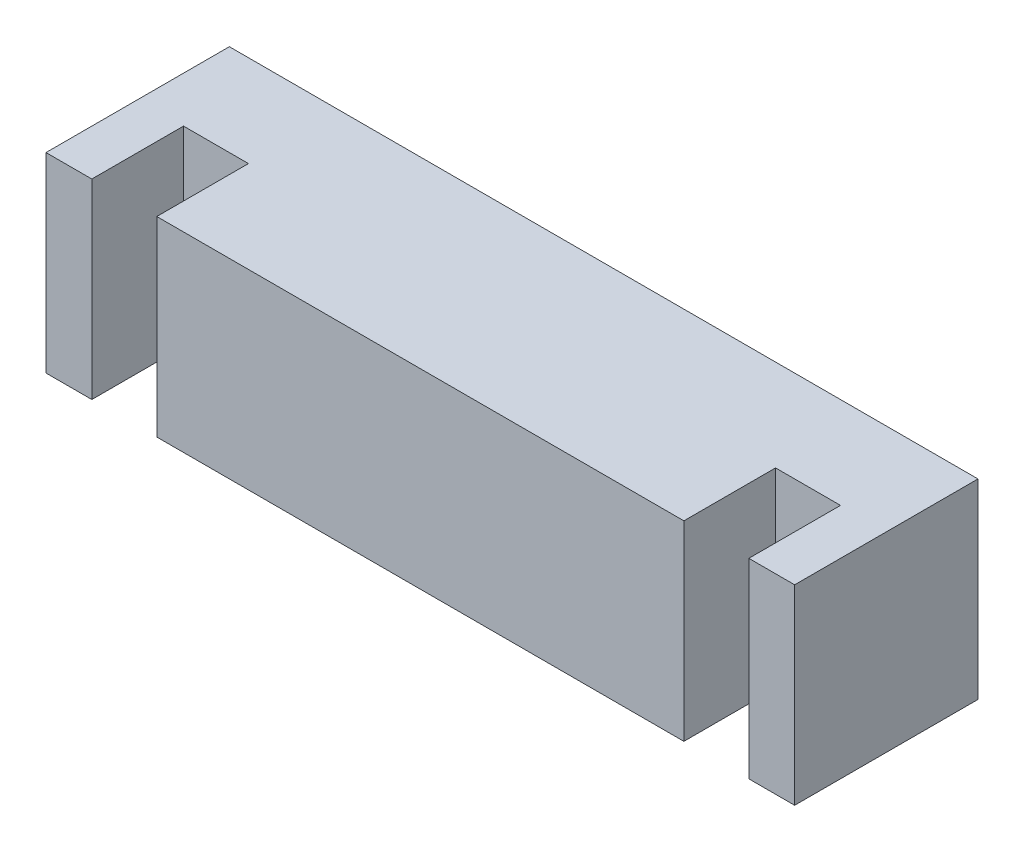
ISO-10303-21;
HEADER;
FILE_DESCRIPTION(('STEP AP214'),'2;1');
FILE_NAME('part.step','',(''),(''),'','','');
FILE_SCHEMA(('AUTOMOTIVE_DESIGN { 1 0 10303 214 1 1 1 1 }'));
ENDSEC;
DATA;
#1=APPLICATION_CONTEXT('core data for automotive mechanical design processes');
#2=APPLICATION_PROTOCOL_DEFINITION('international standard','automotive_design',2000,#1);
#3=PRODUCT_CONTEXT('',#1,'mechanical');
#4=PRODUCT('Part','Part','',(#3));
#5=PRODUCT_RELATED_PRODUCT_CATEGORY('part','',(#4));
#6=PRODUCT_DEFINITION_FORMATION('','',#4);
#7=PRODUCT_DEFINITION_CONTEXT('part definition',#1,'design');
#8=PRODUCT_DEFINITION('design','',#6,#7);
#9=PRODUCT_DEFINITION_SHAPE('','',#8);
#10=(LENGTH_UNIT() NAMED_UNIT(*) SI_UNIT(.MILLI.,.METRE.));
#11=(NAMED_UNIT(*) PLANE_ANGLE_UNIT() SI_UNIT($,.RADIAN.));
#12=(NAMED_UNIT(*) SI_UNIT($,.STERADIAN.) SOLID_ANGLE_UNIT());
#13=UNCERTAINTY_MEASURE_WITH_UNIT(LENGTH_MEASURE(1.E-05),#10,'distance_accuracy_value','');
#14=(GEOMETRIC_REPRESENTATION_CONTEXT(3) GLOBAL_UNCERTAINTY_ASSIGNED_CONTEXT((#13)) GLOBAL_UNIT_ASSIGNED_CONTEXT((#10,
#11,#12)) REPRESENTATION_CONTEXT('',''));
#15=CARTESIAN_POINT('',(0.,0.,0.));
#16=DIRECTION('',(0.,0.,1.));
#17=DIRECTION('',(1.,0.,0.));
#18=AXIS2_PLACEMENT_3D('',#15,#16,#17);
#19=CARTESIAN_POINT('',(0.,0.,2.4));
#20=DIRECTION('',(0.,0.,-1.));
#21=DIRECTION('',(-1.,0.,0.));
#22=AXIS2_PLACEMENT_3D('',#19,#20,#21);
#23=PLANE('',#22);
#24=DIRECTION('',(0.,1.,0.));
#25=VECTOR('',#24,1.);
#26=CARTESIAN_POINT('',(16.7,0.,2.4));
#27=LINE('',#26,#25);
#28=CARTESIAN_POINT('',(16.7,0.,2.4));
#29=VERTEX_POINT('',#28);
#30=CARTESIAN_POINT('',(16.7,5.,2.4));
#31=VERTEX_POINT('',#30);
#32=EDGE_CURVE('E48',#29,#31,#27,.T.);
#33=ORIENTED_EDGE('',*,*,#32,.F.);
#34=DIRECTION('',(1.,0.,0.));
#35=VECTOR('',#34,1.);
#36=CARTESIAN_POINT('',(0.,0.,2.4));
#37=LINE('',#36,#35);
#38=CARTESIAN_POINT('',(18.4,0.,2.4));
#39=VERTEX_POINT('',#38);
#40=EDGE_CURVE('E191',#29,#39,#37,.T.);
#41=ORIENTED_EDGE('',*,*,#40,.T.);
#42=DIRECTION('',(0.,-1.,0.));
#43=VECTOR('',#42,1.);
#44=CARTESIAN_POINT('',(18.4,0.,2.4));
#45=LINE('',#44,#43);
#46=CARTESIAN_POINT('',(18.4,5.,2.4));
#47=VERTEX_POINT('',#46);
#48=EDGE_CURVE('E145',#47,#39,#45,.T.);
#49=ORIENTED_EDGE('',*,*,#48,.F.);
#50=DIRECTION('',(-1.,0.,0.));
#51=VECTOR('',#50,1.);
#52=CARTESIAN_POINT('',(0.,5.,2.4));
#53=LINE('',#52,#51);
#54=EDGE_CURVE('E192',#47,#31,#53,.T.);
#55=ORIENTED_EDGE('',*,*,#54,.T.);
#56=EDGE_LOOP('',(#33,#41,#49,#55));
#57=FACE_BOUND('',#56,.T.);
#58=ADVANCED_FACE('F33',(#57),#23,.F.);
#59=DIRECTION('',(0.,-1.,0.));
#60=VECTOR('',#59,1.);
#61=CARTESIAN_POINT('',(2.9,0.,2.4));
#62=LINE('',#61,#60);
#63=CARTESIAN_POINT('',(2.9,5.,2.4));
#64=VERTEX_POINT('',#63);
#65=CARTESIAN_POINT('',(2.9,0.,2.4));
#66=VERTEX_POINT('',#65);
#67=EDGE_CURVE('E142',#64,#66,#62,.T.);
#68=ORIENTED_EDGE('',*,*,#67,.F.);
#69=CARTESIAN_POINT('',(1.2,5.,2.4));
#70=VERTEX_POINT('',#69);
#71=EDGE_CURVE('E190',#64,#70,#53,.T.);
#72=ORIENTED_EDGE('',*,*,#71,.T.);
#73=DIRECTION('',(0.,1.,0.));
#74=VECTOR('',#73,1.);
#75=CARTESIAN_POINT('',(1.2,5.,2.4));
#76=LINE('',#75,#74);
#77=CARTESIAN_POINT('',(1.2,0.,2.4));
#78=VERTEX_POINT('',#77);
#79=EDGE_CURVE('E169',#78,#70,#76,.T.);
#80=ORIENTED_EDGE('',*,*,#79,.F.);
#81=EDGE_CURVE('E56',#78,#66,#37,.T.);
#82=ORIENTED_EDGE('',*,*,#81,.T.);
#83=EDGE_LOOP('',(#68,#72,#80,#82));
#84=FACE_BOUND('',#83,.T.);
#85=ADVANCED_FACE('F230',(#84),#23,.F.);
#86=CARTESIAN_POINT('',(0.,0.,2.4));
#87=DIRECTION('',(1.,0.,0.));
#88=DIRECTION('',(0.,0.,-1.));
#89=AXIS2_PLACEMENT_3D('',#86,#87,#88);
#90=PLANE('',#89);
#91=DIRECTION('',(0.,-1.,0.));
#92=VECTOR('',#91,1.);
#93=CARTESIAN_POINT('',(0.,0.,0.));
#94=LINE('',#93,#92);
#95=CARTESIAN_POINT('',(0.,5.,0.));
#96=VERTEX_POINT('',#95);
#97=CARTESIAN_POINT('',(0.,0.,0.));
#98=VERTEX_POINT('',#97);
#99=EDGE_CURVE('E188',#96,#98,#94,.T.);
#100=ORIENTED_EDGE('',*,*,#99,.T.);
#101=DIRECTION('',(0.,0.,-1.));
#102=VECTOR('',#101,1.);
#103=CARTESIAN_POINT('',(0.,0.,2.4));
#104=LINE('',#103,#102);
#105=CARTESIAN_POINT('',(0.,0.,4.8));
#106=VERTEX_POINT('',#105);
#107=EDGE_CURVE('E11',#106,#98,#104,.T.);
#108=ORIENTED_EDGE('',*,*,#107,.F.);
#109=DIRECTION('',(0.,-1.,0.));
#110=VECTOR('',#109,1.);
#111=CARTESIAN_POINT('',(0.,5.,4.8));
#112=LINE('',#111,#110);
#113=CARTESIAN_POINT('',(0.,5.,4.8));
#114=VERTEX_POINT('',#113);
#115=EDGE_CURVE('E170',#114,#106,#112,.T.);
#116=ORIENTED_EDGE('',*,*,#115,.F.);
#117=DIRECTION('',(0.,0.,-1.));
#118=VECTOR('',#117,1.);
#119=CARTESIAN_POINT('',(0.,5.,2.4));
#120=LINE('',#119,#118);
#121=EDGE_CURVE('E194',#114,#96,#120,.T.);
#122=ORIENTED_EDGE('',*,*,#121,.T.);
#123=EDGE_LOOP('',(#100,#108,#116,#122));
#124=FACE_BOUND('',#123,.T.);
#125=ADVANCED_FACE('F35',(#124),#90,.F.);
#126=CARTESIAN_POINT('',(0.,0.,2.4));
#127=DIRECTION('',(0.,1.,0.));
#128=DIRECTION('',(0.,0.,1.));
#129=AXIS2_PLACEMENT_3D('',#126,#127,#128);
#130=PLANE('',#129);
#131=DIRECTION('',(1.,0.,0.));
#132=VECTOR('',#131,1.);
#133=CARTESIAN_POINT('',(0.,0.,0.));
#134=LINE('',#133,#132);
#135=CARTESIAN_POINT('',(19.6,0.,0.));
#136=VERTEX_POINT('',#135);
#137=EDGE_CURVE('E197',#98,#136,#134,.T.);
#138=ORIENTED_EDGE('',*,*,#137,.T.);
#139=DIRECTION('',(0.,0.,-1.));
#140=VECTOR('',#139,1.);
#141=CARTESIAN_POINT('',(19.6,0.,2.4));
#142=LINE('',#141,#140);
#143=CARTESIAN_POINT('',(19.6,0.,4.8));
#144=VERTEX_POINT('',#143);
#145=EDGE_CURVE('E41',#144,#136,#142,.T.);
#146=ORIENTED_EDGE('',*,*,#145,.F.);
#147=DIRECTION('',(1.,0.,0.));
#148=VECTOR('',#147,1.);
#149=CARTESIAN_POINT('',(19.6,0.,4.8));
#150=LINE('',#149,#148);
#151=CARTESIAN_POINT('',(18.4,0.,4.8));
#152=VERTEX_POINT('',#151);
#153=EDGE_CURVE('E160',#152,#144,#150,.T.);
#154=ORIENTED_EDGE('',*,*,#153,.F.);
#155=DIRECTION('',(0.,0.,-1.));
#156=VECTOR('',#155,1.);
#157=CARTESIAN_POINT('',(18.4,0.,4.8));
#158=LINE('',#157,#156);
#159=EDGE_CURVE('E162',#152,#39,#158,.T.);
#160=ORIENTED_EDGE('',*,*,#159,.T.);
#161=ORIENTED_EDGE('',*,*,#40,.F.);
#162=DIRECTION('',(0.,0.,-1.));
#163=VECTOR('',#162,1.);
#164=CARTESIAN_POINT('',(16.7,0.,4.8));
#165=LINE('',#164,#163);
#166=CARTESIAN_POINT('',(16.7,0.,4.8));
#167=VERTEX_POINT('',#166);
#168=EDGE_CURVE('E235',#167,#29,#165,.T.);
#169=ORIENTED_EDGE('',*,*,#168,.F.);
#170=DIRECTION('',(1.,0.,0.));
#171=VECTOR('',#170,1.);
#172=CARTESIAN_POINT('',(2.9,0.,4.8));
#173=LINE('',#172,#171);
#174=CARTESIAN_POINT('',(2.9,0.,4.8));
#175=VERTEX_POINT('',#174);
#176=EDGE_CURVE('E138',#175,#167,#173,.T.);
#177=ORIENTED_EDGE('',*,*,#176,.F.);
#178=DIRECTION('',(0.,0.,-1.));
#179=VECTOR('',#178,1.);
#180=CARTESIAN_POINT('',(2.9,0.,4.8));
#181=LINE('',#180,#179);
#182=EDGE_CURVE('E150',#175,#66,#181,.T.);
#183=ORIENTED_EDGE('',*,*,#182,.T.);
#184=ORIENTED_EDGE('',*,*,#81,.F.);
#185=DIRECTION('',(0.,0.,-1.));
#186=VECTOR('',#185,1.);
#187=CARTESIAN_POINT('',(1.2,0.,4.8));
#188=LINE('',#187,#186);
#189=CARTESIAN_POINT('',(1.2,0.,4.8));
#190=VERTEX_POINT('',#189);
#191=EDGE_CURVE('E185',#190,#78,#188,.T.);
#192=ORIENTED_EDGE('',*,*,#191,.F.);
#193=DIRECTION('',(1.,0.,0.));
#194=VECTOR('',#193,1.);
#195=CARTESIAN_POINT('',(0.,0.,4.8));
#196=LINE('',#195,#194);
#197=EDGE_CURVE('E173',#106,#190,#196,.T.);
#198=ORIENTED_EDGE('',*,*,#197,.F.);
#199=ORIENTED_EDGE('',*,*,#107,.T.);
#200=EDGE_LOOP('',(#138,#146,#154,#160,#161,#169,#177,#183,#184,#192,#198,#199));
#201=FACE_BOUND('',#200,.T.);
#202=ADVANCED_FACE('F232',(#201),#130,.F.);
#203=CARTESIAN_POINT('',(19.6,0.,2.4));
#204=DIRECTION('',(-1.,0.,0.));
#205=DIRECTION('',(0.,0.,1.));
#206=AXIS2_PLACEMENT_3D('',#203,#204,#205);
#207=PLANE('',#206);
#208=DIRECTION('',(0.,1.,0.));
#209=VECTOR('',#208,1.);
#210=CARTESIAN_POINT('',(19.6,0.,0.));
#211=LINE('',#210,#209);
#212=CARTESIAN_POINT('',(19.6,5.,0.));
#213=VERTEX_POINT('',#212);
#214=EDGE_CURVE('E199',#136,#213,#211,.T.);
#215=ORIENTED_EDGE('',*,*,#214,.T.);
#216=DIRECTION('',(0.,0.,-1.));
#217=VECTOR('',#216,1.);
#218=CARTESIAN_POINT('',(19.6,5.,2.4));
#219=LINE('',#218,#217);
#220=CARTESIAN_POINT('',(19.6,5.,4.8));
#221=VERTEX_POINT('',#220);
#222=EDGE_CURVE('E205',#221,#213,#219,.T.);
#223=ORIENTED_EDGE('',*,*,#222,.F.);
#224=DIRECTION('',(0.,1.,0.));
#225=VECTOR('',#224,1.);
#226=CARTESIAN_POINT('',(19.6,0.,4.8));
#227=LINE('',#226,#225);
#228=EDGE_CURVE('E148',#144,#221,#227,.T.);
#229=ORIENTED_EDGE('',*,*,#228,.F.);
#230=ORIENTED_EDGE('',*,*,#145,.T.);
#231=EDGE_LOOP('',(#215,#223,#229,#230));
#232=FACE_BOUND('',#231,.T.);
#233=ADVANCED_FACE('F211',(#232),#207,.F.);
#234=CARTESIAN_POINT('',(0.,5.,2.4));
#235=DIRECTION('',(0.,-1.,0.));
#236=DIRECTION('',(0.,0.,-1.));
#237=AXIS2_PLACEMENT_3D('',#234,#235,#236);
#238=PLANE('',#237);
#239=DIRECTION('',(-1.,0.,0.));
#240=VECTOR('',#239,1.);
#241=CARTESIAN_POINT('',(0.,5.,0.));
#242=LINE('',#241,#240);
#243=EDGE_CURVE('E201',#213,#96,#242,.T.);
#244=ORIENTED_EDGE('',*,*,#243,.T.);
#245=ORIENTED_EDGE('',*,*,#121,.F.);
#246=DIRECTION('',(-1.,0.,0.));
#247=VECTOR('',#246,1.);
#248=CARTESIAN_POINT('',(0.,5.,4.8));
#249=LINE('',#248,#247);
#250=CARTESIAN_POINT('',(1.2,5.,4.8));
#251=VERTEX_POINT('',#250);
#252=EDGE_CURVE('E177',#251,#114,#249,.T.);
#253=ORIENTED_EDGE('',*,*,#252,.F.);
#254=DIRECTION('',(0.,0.,-1.));
#255=VECTOR('',#254,1.);
#256=CARTESIAN_POINT('',(1.2,5.,4.8));
#257=LINE('',#256,#255);
#258=EDGE_CURVE('E180',#251,#70,#257,.T.);
#259=ORIENTED_EDGE('',*,*,#258,.T.);
#260=ORIENTED_EDGE('',*,*,#71,.F.);
#261=DIRECTION('',(0.,0.,-1.));
#262=VECTOR('',#261,1.);
#263=CARTESIAN_POINT('',(2.9,5.,4.8));
#264=LINE('',#263,#262);
#265=CARTESIAN_POINT('',(2.9,5.,4.8));
#266=VERTEX_POINT('',#265);
#267=EDGE_CURVE('E129',#266,#64,#264,.T.);
#268=ORIENTED_EDGE('',*,*,#267,.F.);
#269=DIRECTION('',(-1.,0.,0.));
#270=VECTOR('',#269,1.);
#271=CARTESIAN_POINT('',(2.9,5.,4.8));
#272=LINE('',#271,#270);
#273=CARTESIAN_POINT('',(16.7,5.,4.8));
#274=VERTEX_POINT('',#273);
#275=EDGE_CURVE('E123',#274,#266,#272,.T.);
#276=ORIENTED_EDGE('',*,*,#275,.F.);
#277=DIRECTION('',(0.,0.,-1.));
#278=VECTOR('',#277,1.);
#279=CARTESIAN_POINT('',(16.7,5.,4.8));
#280=LINE('',#279,#278);
#281=EDGE_CURVE('E127',#274,#31,#280,.T.);
#282=ORIENTED_EDGE('',*,*,#281,.T.);
#283=ORIENTED_EDGE('',*,*,#54,.F.);
#284=DIRECTION('',(0.,0.,-1.));
#285=VECTOR('',#284,1.);
#286=CARTESIAN_POINT('',(18.4,5.,4.8));
#287=LINE('',#286,#285);
#288=CARTESIAN_POINT('',(18.4,5.,4.8));
#289=VERTEX_POINT('',#288);
#290=EDGE_CURVE('E166',#289,#47,#287,.T.);
#291=ORIENTED_EDGE('',*,*,#290,.F.);
#292=DIRECTION('',(-1.,0.,0.));
#293=VECTOR('',#292,1.);
#294=CARTESIAN_POINT('',(19.6,5.,4.8));
#295=LINE('',#294,#293);
#296=EDGE_CURVE('E156',#221,#289,#295,.T.);
#297=ORIENTED_EDGE('',*,*,#296,.F.);
#298=ORIENTED_EDGE('',*,*,#222,.T.);
#299=EDGE_LOOP('',(#244,#245,#253,#259,#260,#268,#276,#282,#283,#291,#297,#298));
#300=FACE_BOUND('',#299,.T.);
#301=ADVANCED_FACE('F125',(#300),#238,.F.);
#302=CARTESIAN_POINT('',(0.,0.,0.));
#303=DIRECTION('',(0.,0.,-1.));
#304=DIRECTION('',(-1.,0.,0.));
#305=AXIS2_PLACEMENT_3D('',#302,#303,#304);
#306=PLANE('',#305);
#307=ORIENTED_EDGE('',*,*,#99,.F.);
#308=ORIENTED_EDGE('',*,*,#243,.F.);
#309=ORIENTED_EDGE('',*,*,#214,.F.);
#310=ORIENTED_EDGE('',*,*,#137,.F.);
#311=EDGE_LOOP('',(#307,#308,#309,#310));
#312=FACE_BOUND('',#311,.T.);
#313=ADVANCED_FACE('F217',(#312),#306,.T.);
#314=CARTESIAN_POINT('',(1.2,5.,4.8));
#315=DIRECTION('',(-1.,0.,0.));
#316=DIRECTION('',(0.,-1.,0.));
#317=AXIS2_PLACEMENT_3D('',#314,#315,#316);
#318=PLANE('',#317);
#319=ORIENTED_EDGE('',*,*,#79,.T.);
#320=ORIENTED_EDGE('',*,*,#258,.F.);
#321=DIRECTION('',(0.,1.,0.));
#322=VECTOR('',#321,1.);
#323=CARTESIAN_POINT('',(1.2,5.,4.8));
#324=LINE('',#323,#322);
#325=EDGE_CURVE('E175',#190,#251,#324,.T.);
#326=ORIENTED_EDGE('',*,*,#325,.F.);
#327=ORIENTED_EDGE('',*,*,#191,.T.);
#328=EDGE_LOOP('',(#319,#320,#326,#327));
#329=FACE_BOUND('',#328,.T.);
#330=ADVANCED_FACE('F229',(#329),#318,.F.);
#331=CARTESIAN_POINT('',(0.,0.,4.8));
#332=DIRECTION('',(0.,0.,1.));
#333=DIRECTION('',(1.,0.,0.));
#334=AXIS2_PLACEMENT_3D('',#331,#332,#333);
#335=PLANE('',#334);
#336=ORIENTED_EDGE('',*,*,#115,.T.);
#337=ORIENTED_EDGE('',*,*,#197,.T.);
#338=ORIENTED_EDGE('',*,*,#325,.T.);
#339=ORIENTED_EDGE('',*,*,#252,.T.);
#340=EDGE_LOOP('',(#336,#337,#338,#339));
#341=FACE_BOUND('',#340,.T.);
#342=ADVANCED_FACE('F224',(#341),#335,.T.);
#343=CARTESIAN_POINT('',(18.4,0.,4.8));
#344=DIRECTION('',(1.,0.,0.));
#345=DIRECTION('',(0.,0.,-1.));
#346=AXIS2_PLACEMENT_3D('',#343,#344,#345);
#347=PLANE('',#346);
#348=ORIENTED_EDGE('',*,*,#48,.T.);
#349=ORIENTED_EDGE('',*,*,#159,.F.);
#350=DIRECTION('',(0.,-1.,0.));
#351=VECTOR('',#350,1.);
#352=CARTESIAN_POINT('',(18.4,0.,4.8));
#353=LINE('',#352,#351);
#354=EDGE_CURVE('E158',#289,#152,#353,.T.);
#355=ORIENTED_EDGE('',*,*,#354,.F.);
#356=ORIENTED_EDGE('',*,*,#290,.T.);
#357=EDGE_LOOP('',(#348,#349,#355,#356));
#358=FACE_BOUND('',#357,.T.);
#359=ADVANCED_FACE('F300',(#358),#347,.F.);
#360=CARTESIAN_POINT('',(0.,0.,4.8));
#361=DIRECTION('',(0.,0.,1.));
#362=DIRECTION('',(1.,0.,0.));
#363=AXIS2_PLACEMENT_3D('',#360,#361,#362);
#364=PLANE('',#363);
#365=ORIENTED_EDGE('',*,*,#228,.T.);
#366=ORIENTED_EDGE('',*,*,#296,.T.);
#367=ORIENTED_EDGE('',*,*,#354,.T.);
#368=ORIENTED_EDGE('',*,*,#153,.T.);
#369=EDGE_LOOP('',(#365,#366,#367,#368));
#370=FACE_BOUND('',#369,.T.);
#371=ADVANCED_FACE('F249',(#370),#364,.T.);
#372=CARTESIAN_POINT('',(16.7,0.,4.8));
#373=DIRECTION('',(-1.,0.,0.));
#374=DIRECTION('',(0.,-1.,0.));
#375=AXIS2_PLACEMENT_3D('',#372,#373,#374);
#376=PLANE('',#375);
#377=ORIENTED_EDGE('',*,*,#32,.T.);
#378=ORIENTED_EDGE('',*,*,#281,.F.);
#379=DIRECTION('',(0.,1.,0.));
#380=VECTOR('',#379,1.);
#381=CARTESIAN_POINT('',(16.7,0.,4.8));
#382=LINE('',#381,#380);
#383=EDGE_CURVE('E133',#167,#274,#382,.T.);
#384=ORIENTED_EDGE('',*,*,#383,.F.);
#385=ORIENTED_EDGE('',*,*,#168,.T.);
#386=EDGE_LOOP('',(#377,#378,#384,#385));
#387=FACE_BOUND('',#386,.T.);
#388=ADVANCED_FACE('F144',(#387),#376,.F.);
#389=CARTESIAN_POINT('',(2.9,0.,4.8));
#390=DIRECTION('',(1.,0.,0.));
#391=DIRECTION('',(0.,0.,-1.));
#392=AXIS2_PLACEMENT_3D('',#389,#390,#391);
#393=PLANE('',#392);
#394=ORIENTED_EDGE('',*,*,#67,.T.);
#395=ORIENTED_EDGE('',*,*,#182,.F.);
#396=DIRECTION('',(0.,-1.,0.));
#397=VECTOR('',#396,1.);
#398=CARTESIAN_POINT('',(2.9,0.,4.8));
#399=LINE('',#398,#397);
#400=EDGE_CURVE('E132',#266,#175,#399,.T.);
#401=ORIENTED_EDGE('',*,*,#400,.F.);
#402=ORIENTED_EDGE('',*,*,#267,.T.);
#403=EDGE_LOOP('',(#394,#395,#401,#402));
#404=FACE_BOUND('',#403,.T.);
#405=ADVANCED_FACE('F241',(#404),#393,.F.);
#406=CARTESIAN_POINT('',(0.,0.,4.8));
#407=DIRECTION('',(0.,0.,-1.));
#408=DIRECTION('',(-1.,0.,0.));
#409=AXIS2_PLACEMENT_3D('',#406,#407,#408);
#410=PLANE('',#409);
#411=ORIENTED_EDGE('',*,*,#383,.T.);
#412=ORIENTED_EDGE('',*,*,#275,.T.);
#413=ORIENTED_EDGE('',*,*,#400,.T.);
#414=ORIENTED_EDGE('',*,*,#176,.T.);
#415=EDGE_LOOP('',(#411,#412,#413,#414));
#416=FACE_BOUND('',#415,.T.);
#417=ADVANCED_FACE('F136',(#416),#410,.F.);
#418=CLOSED_SHELL('',(#58,#85,#125,#202,#233,#301,#313,#330,#342,#359,#371,#388,#405,#417));
#419=MANIFOLD_SOLID_BREP('B2',#418);
#420=ADVANCED_BREP_SHAPE_REPRESENTATION('',(#18,#419),#14);
#421=SHAPE_DEFINITION_REPRESENTATION(#9,#420);
ENDSEC;
END-ISO-10303-21;
